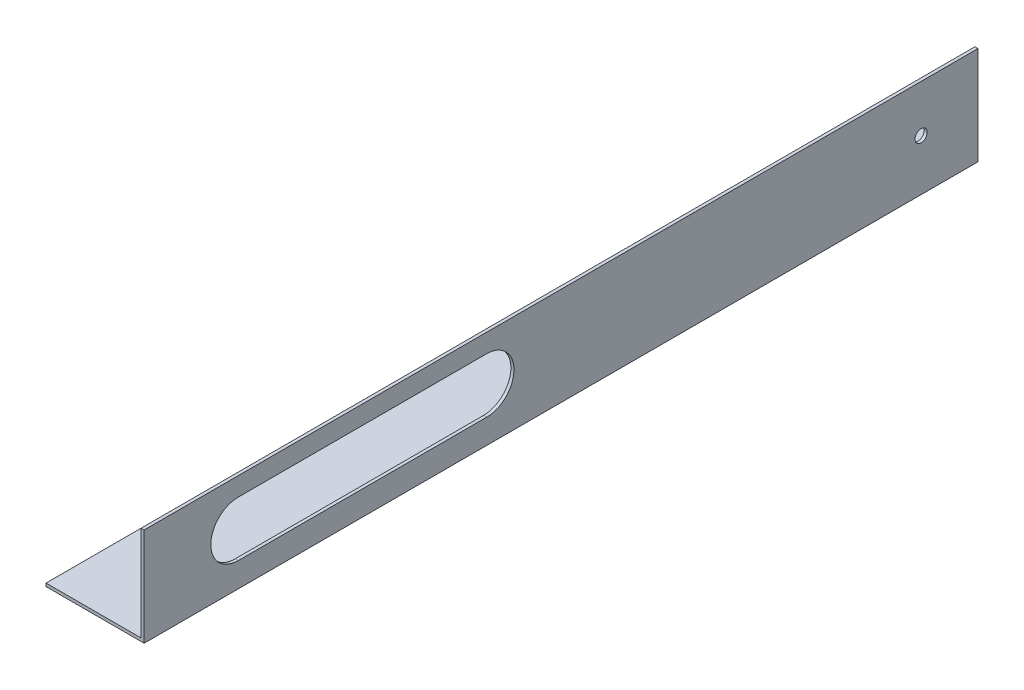
ISO-10303-21;
HEADER;
FILE_DESCRIPTION(('STEP AP214'),'2;1');
FILE_NAME('part.step','',(''),(''),'','','');
FILE_SCHEMA(('AUTOMOTIVE_DESIGN { 1 0 10303 214 1 1 1 1 }'));
ENDSEC;
DATA;
#1=APPLICATION_CONTEXT('core data for automotive mechanical design processes');
#2=APPLICATION_PROTOCOL_DEFINITION('international standard','automotive_design',2000,#1);
#3=PRODUCT_CONTEXT('',#1,'mechanical');
#4=PRODUCT('Part','Part','',(#3));
#5=PRODUCT_RELATED_PRODUCT_CATEGORY('part','',(#4));
#6=PRODUCT_DEFINITION_FORMATION('','',#4);
#7=PRODUCT_DEFINITION_CONTEXT('part definition',#1,'design');
#8=PRODUCT_DEFINITION('design','',#6,#7);
#9=PRODUCT_DEFINITION_SHAPE('','',#8);
#10=(LENGTH_UNIT() NAMED_UNIT(*) SI_UNIT(.MILLI.,.METRE.));
#11=(NAMED_UNIT(*) PLANE_ANGLE_UNIT() SI_UNIT($,.RADIAN.));
#12=(NAMED_UNIT(*) SI_UNIT($,.STERADIAN.) SOLID_ANGLE_UNIT());
#13=UNCERTAINTY_MEASURE_WITH_UNIT(LENGTH_MEASURE(1.E-05),#10,'distance_accuracy_value','');
#14=(GEOMETRIC_REPRESENTATION_CONTEXT(3) GLOBAL_UNCERTAINTY_ASSIGNED_CONTEXT((#13)) GLOBAL_UNIT_ASSIGNED_CONTEXT((#10,
#11,#12)) REPRESENTATION_CONTEXT('',''));
#15=CARTESIAN_POINT('',(0.,0.,0.));
#16=DIRECTION('',(0.,0.,1.));
#17=DIRECTION('',(1.,0.,0.));
#18=AXIS2_PLACEMENT_3D('',#15,#16,#17);
#19=CARTESIAN_POINT('',(50.8,0.,431.8));
#20=DIRECTION('',(0.,1.,0.));
#21=DIRECTION('',(-1.,0.,0.));
#22=AXIS2_PLACEMENT_3D('',#19,#20,#21);
#23=PLANE('',#22);
#24=DIRECTION('',(1.,0.,0.));
#25=VECTOR('',#24,1.);
#26=CARTESIAN_POINT('',(50.8,0.,0.));
#27=LINE('',#26,#25);
#28=CARTESIAN_POINT('',(0.,0.,0.));
#29=VERTEX_POINT('',#28);
#30=CARTESIAN_POINT('',(50.8,0.,0.));
#31=VERTEX_POINT('',#30);
#32=EDGE_CURVE('E155',#29,#31,#27,.T.);
#33=ORIENTED_EDGE('',*,*,#32,.T.);
#34=DIRECTION('',(0.,0.,-1.));
#35=VECTOR('',#34,1.);
#36=CARTESIAN_POINT('',(50.8,0.,431.8));
#37=LINE('',#36,#35);
#38=CARTESIAN_POINT('',(50.8,0.,431.8));
#39=VERTEX_POINT('',#38);
#40=EDGE_CURVE('E181',#39,#31,#37,.T.);
#41=ORIENTED_EDGE('',*,*,#40,.F.);
#42=DIRECTION('',(1.,0.,0.));
#43=VECTOR('',#42,1.);
#44=CARTESIAN_POINT('',(50.8,0.,431.8));
#45=LINE('',#44,#43);
#46=CARTESIAN_POINT('',(0.,0.,431.8));
#47=VERTEX_POINT('',#46);
#48=EDGE_CURVE('E140',#47,#39,#45,.T.);
#49=ORIENTED_EDGE('',*,*,#48,.F.);
#50=DIRECTION('',(0.,0.,-1.));
#51=VECTOR('',#50,1.);
#52=CARTESIAN_POINT('',(0.,0.,431.8));
#53=LINE('',#52,#51);
#54=EDGE_CURVE('E154',#47,#29,#53,.T.);
#55=ORIENTED_EDGE('',*,*,#54,.T.);
#56=EDGE_LOOP('',(#33,#41,#49,#55));
#57=FACE_BOUND('',#56,.T.);
#58=ADVANCED_FACE('F32',(#57),#23,.F.);
#59=CARTESIAN_POINT('',(50.8,50.8,431.8));
#60=DIRECTION('',(-1.,0.,0.));
#61=DIRECTION('',(0.,0.,1.));
#62=AXIS2_PLACEMENT_3D('',#59,#60,#61);
#63=PLANE('',#62);
#64=DIRECTION('',(0.,0.,1.));
#65=VECTOR('',#64,1.);
#66=CARTESIAN_POINT('',(50.8,41.148,254.508));
#67=LINE('',#66,#65);
#68=CARTESIAN_POINT('',(50.8,41.148,254.508));
#69=VERTEX_POINT('',#68);
#70=CARTESIAN_POINT('',(50.8,41.148,383.032));
#71=VERTEX_POINT('',#70);
#72=EDGE_CURVE('E120',#69,#71,#67,.T.);
#73=ORIENTED_EDGE('',*,*,#72,.F.);
#74=CARTESIAN_POINT('',(50.8,26.924,254.508));
#75=DIRECTION('',(1.,0.,0.));
#76=DIRECTION('',(0.,0.,-1.));
#77=AXIS2_PLACEMENT_3D('',#74,#75,#76);
#78=CIRCLE('',#77,14.224);
#79=CARTESIAN_POINT('',(50.8,12.7,254.508));
#80=VERTEX_POINT('',#79);
#81=EDGE_CURVE('E46',#80,#69,#78,.T.);
#82=ORIENTED_EDGE('',*,*,#81,.F.);
#83=DIRECTION('',(0.,0.,-1.));
#84=VECTOR('',#83,1.);
#85=CARTESIAN_POINT('',(50.8,12.7,254.508));
#86=LINE('',#85,#84);
#87=CARTESIAN_POINT('',(50.8,12.7,383.032));
#88=VERTEX_POINT('',#87);
#89=EDGE_CURVE('E127',#88,#80,#86,.T.);
#90=ORIENTED_EDGE('',*,*,#89,.F.);
#91=CARTESIAN_POINT('',(50.8,26.924,383.032));
#92=DIRECTION('',(1.,0.,0.));
#93=DIRECTION('',(0.,0.,-1.));
#94=AXIS2_PLACEMENT_3D('',#91,#92,#93);
#95=CIRCLE('',#94,14.224);
#96=EDGE_CURVE('E111',#71,#88,#95,.T.);
#97=ORIENTED_EDGE('',*,*,#96,.F.);
#98=EDGE_LOOP('',(#73,#82,#90,#97));
#99=FACE_BOUND('',#98,.T.);
#100=CARTESIAN_POINT('',(50.8,26.416,29.464));
#101=DIRECTION('',(1.,0.,0.));
#102=DIRECTION('',(0.,0.,-1.));
#103=AXIS2_PLACEMENT_3D('',#100,#101,#102);
#104=CIRCLE('',#103,3.175);
#105=CARTESIAN_POINT('',(50.8,26.416,26.289));
#106=VERTEX_POINT('',#105);
#107=EDGE_CURVE('E137',#106,#106,#104,.T.);
#108=ORIENTED_EDGE('',*,*,#107,.F.);
#109=EDGE_LOOP('',(#108));
#110=FACE_BOUND('',#109,.T.);
#111=DIRECTION('',(0.,1.,0.));
#112=VECTOR('',#111,1.);
#113=CARTESIAN_POINT('',(50.8,50.8,0.));
#114=LINE('',#113,#112);
#115=CARTESIAN_POINT('',(50.8,50.8,0.));
#116=VERTEX_POINT('',#115);
#117=EDGE_CURVE('E158',#31,#116,#114,.T.);
#118=ORIENTED_EDGE('',*,*,#117,.T.);
#119=DIRECTION('',(0.,0.,-1.));
#120=VECTOR('',#119,1.);
#121=CARTESIAN_POINT('',(50.8,50.8,431.8));
#122=LINE('',#121,#120);
#123=CARTESIAN_POINT('',(50.8,50.8,431.8));
#124=VERTEX_POINT('',#123);
#125=EDGE_CURVE('E178',#124,#116,#122,.T.);
#126=ORIENTED_EDGE('',*,*,#125,.F.);
#127=DIRECTION('',(0.,1.,0.));
#128=VECTOR('',#127,1.);
#129=CARTESIAN_POINT('',(50.8,50.8,431.8));
#130=LINE('',#129,#128);
#131=EDGE_CURVE('E143',#39,#124,#130,.T.);
#132=ORIENTED_EDGE('',*,*,#131,.F.);
#133=ORIENTED_EDGE('',*,*,#40,.T.);
#134=EDGE_LOOP('',(#118,#126,#132,#133));
#135=FACE_BOUND('',#134,.T.);
#136=ADVANCED_FACE('F124',(#99,#110,#135),#63,.F.);
#137=CARTESIAN_POINT('',(49.2125,50.8,431.8));
#138=DIRECTION('',(0.,-1.,0.));
#139=DIRECTION('',(0.,0.,-1.));
#140=AXIS2_PLACEMENT_3D('',#137,#138,#139);
#141=PLANE('',#140);
#142=DIRECTION('',(-1.,0.,0.));
#143=VECTOR('',#142,1.);
#144=CARTESIAN_POINT('',(49.2125,50.8,0.));
#145=LINE('',#144,#143);
#146=CARTESIAN_POINT('',(49.2125,50.8,0.));
#147=VERTEX_POINT('',#146);
#148=EDGE_CURVE('E160',#116,#147,#145,.T.);
#149=ORIENTED_EDGE('',*,*,#148,.T.);
#150=DIRECTION('',(0.,0.,-1.));
#151=VECTOR('',#150,1.);
#152=CARTESIAN_POINT('',(49.2125,50.8,431.8));
#153=LINE('',#152,#151);
#154=CARTESIAN_POINT('',(49.2125,50.8,431.8));
#155=VERTEX_POINT('',#154);
#156=EDGE_CURVE('E175',#155,#147,#153,.T.);
#157=ORIENTED_EDGE('',*,*,#156,.F.);
#158=DIRECTION('',(-1.,0.,0.));
#159=VECTOR('',#158,1.);
#160=CARTESIAN_POINT('',(49.2125,50.8,431.8));
#161=LINE('',#160,#159);
#162=EDGE_CURVE('E146',#124,#155,#161,.T.);
#163=ORIENTED_EDGE('',*,*,#162,.F.);
#164=ORIENTED_EDGE('',*,*,#125,.T.);
#165=EDGE_LOOP('',(#149,#157,#163,#164));
#166=FACE_BOUND('',#165,.T.);
#167=ADVANCED_FACE('F213',(#166),#141,.F.);
#168=CARTESIAN_POINT('',(49.2125,1.58749999999999,431.8));
#169=DIRECTION('',(1.,0.,0.));
#170=DIRECTION('',(0.,0.,-1.));
#171=AXIS2_PLACEMENT_3D('',#168,#169,#170);
#172=PLANE('',#171);
#173=DIRECTION('',(0.,0.,-1.));
#174=VECTOR('',#173,1.);
#175=CARTESIAN_POINT('',(49.2125,12.7,431.8));
#176=LINE('',#175,#174);
#177=CARTESIAN_POINT('',(49.2125,12.7,383.032));
#178=VERTEX_POINT('',#177);
#179=CARTESIAN_POINT('',(49.2125,12.7,254.508));
#180=VERTEX_POINT('',#179);
#181=EDGE_CURVE('E39',#178,#180,#176,.T.);
#182=ORIENTED_EDGE('',*,*,#181,.T.);
#183=CARTESIAN_POINT('',(49.2125,26.924,254.508));
#184=DIRECTION('',(1.,0.,0.));
#185=DIRECTION('',(0.,0.,-1.));
#186=AXIS2_PLACEMENT_3D('',#183,#184,#185);
#187=CIRCLE('',#186,14.224);
#188=CARTESIAN_POINT('',(49.2125,41.148,254.508));
#189=VERTEX_POINT('',#188);
#190=EDGE_CURVE('E11',#180,#189,#187,.T.);
#191=ORIENTED_EDGE('',*,*,#190,.T.);
#192=DIRECTION('',(0.,0.,1.));
#193=VECTOR('',#192,1.);
#194=CARTESIAN_POINT('',(49.2125,41.148,431.8));
#195=LINE('',#194,#193);
#196=CARTESIAN_POINT('',(49.2125,41.148,383.032));
#197=VERTEX_POINT('',#196);
#198=EDGE_CURVE('E184',#189,#197,#195,.T.);
#199=ORIENTED_EDGE('',*,*,#198,.T.);
#200=CARTESIAN_POINT('',(49.2125,26.924,383.032));
#201=DIRECTION('',(1.,0.,0.));
#202=DIRECTION('',(0.,0.,-1.));
#203=AXIS2_PLACEMENT_3D('',#200,#201,#202);
#204=CIRCLE('',#203,14.224);
#205=EDGE_CURVE('E114',#197,#178,#204,.T.);
#206=ORIENTED_EDGE('',*,*,#205,.T.);
#207=EDGE_LOOP('',(#182,#191,#199,#206));
#208=FACE_BOUND('',#207,.T.);
#209=CARTESIAN_POINT('',(49.2125,26.416,29.464));
#210=DIRECTION('',(1.,0.,0.));
#211=DIRECTION('',(0.,0.,-1.));
#212=AXIS2_PLACEMENT_3D('',#209,#210,#211);
#213=CIRCLE('',#212,3.175);
#214=CARTESIAN_POINT('',(49.2125,26.416,26.289));
#215=VERTEX_POINT('',#214);
#216=EDGE_CURVE('E134',#215,#215,#213,.T.);
#217=ORIENTED_EDGE('',*,*,#216,.T.);
#218=EDGE_LOOP('',(#217));
#219=FACE_BOUND('',#218,.T.);
#220=DIRECTION('',(0.,-1.,0.));
#221=VECTOR('',#220,1.);
#222=CARTESIAN_POINT('',(49.2125,1.58749999999999,0.));
#223=LINE('',#222,#221);
#224=CARTESIAN_POINT('',(49.2125,1.58749999999999,0.));
#225=VERTEX_POINT('',#224);
#226=EDGE_CURVE('E162',#147,#225,#223,.T.);
#227=ORIENTED_EDGE('',*,*,#226,.T.);
#228=DIRECTION('',(0.,0.,-1.));
#229=VECTOR('',#228,1.);
#230=CARTESIAN_POINT('',(49.2125,1.58749999999999,431.8));
#231=LINE('',#230,#229);
#232=CARTESIAN_POINT('',(49.2125,1.58749999999999,431.8));
#233=VERTEX_POINT('',#232);
#234=EDGE_CURVE('E172',#233,#225,#231,.T.);
#235=ORIENTED_EDGE('',*,*,#234,.F.);
#236=DIRECTION('',(0.,-1.,0.));
#237=VECTOR('',#236,1.);
#238=CARTESIAN_POINT('',(49.2125,1.58749999999999,431.8));
#239=LINE('',#238,#237);
#240=EDGE_CURVE('E148',#155,#233,#239,.T.);
#241=ORIENTED_EDGE('',*,*,#240,.F.);
#242=ORIENTED_EDGE('',*,*,#156,.T.);
#243=EDGE_LOOP('',(#227,#235,#241,#242));
#244=FACE_BOUND('',#243,.T.);
#245=ADVANCED_FACE('F190',(#208,#219,#244),#172,.F.);
#246=CARTESIAN_POINT('',(0.,1.58749999999999,431.8));
#247=DIRECTION('',(0.,-1.,0.));
#248=DIRECTION('',(0.,0.,-1.));
#249=AXIS2_PLACEMENT_3D('',#246,#247,#248);
#250=PLANE('',#249);
#251=DIRECTION('',(-1.,0.,0.));
#252=VECTOR('',#251,1.);
#253=CARTESIAN_POINT('',(0.,1.58749999999999,0.));
#254=LINE('',#253,#252);
#255=CARTESIAN_POINT('',(0.,1.58749999999999,0.));
#256=VERTEX_POINT('',#255);
#257=EDGE_CURVE('E164',#225,#256,#254,.T.);
#258=ORIENTED_EDGE('',*,*,#257,.T.);
#259=DIRECTION('',(0.,0.,-1.));
#260=VECTOR('',#259,1.);
#261=CARTESIAN_POINT('',(0.,1.58749999999999,431.8));
#262=LINE('',#261,#260);
#263=CARTESIAN_POINT('',(0.,1.58749999999999,431.8));
#264=VERTEX_POINT('',#263);
#265=EDGE_CURVE('E169',#264,#256,#262,.T.);
#266=ORIENTED_EDGE('',*,*,#265,.F.);
#267=DIRECTION('',(-1.,0.,0.));
#268=VECTOR('',#267,1.);
#269=CARTESIAN_POINT('',(0.,1.58749999999999,431.8));
#270=LINE('',#269,#268);
#271=EDGE_CURVE('E150',#233,#264,#270,.T.);
#272=ORIENTED_EDGE('',*,*,#271,.F.);
#273=ORIENTED_EDGE('',*,*,#234,.T.);
#274=EDGE_LOOP('',(#258,#266,#272,#273));
#275=FACE_BOUND('',#274,.T.);
#276=ADVANCED_FACE('F234',(#275),#250,.F.);
#277=CARTESIAN_POINT('',(0.,0.,431.8));
#278=DIRECTION('',(1.,0.,0.));
#279=DIRECTION('',(0.,0.,-1.));
#280=AXIS2_PLACEMENT_3D('',#277,#278,#279);
#281=PLANE('',#280);
#282=DIRECTION('',(0.,-1.,0.));
#283=VECTOR('',#282,1.);
#284=CARTESIAN_POINT('',(0.,0.,0.));
#285=LINE('',#284,#283);
#286=EDGE_CURVE('E144',#256,#29,#285,.T.);
#287=ORIENTED_EDGE('',*,*,#286,.T.);
#288=ORIENTED_EDGE('',*,*,#54,.F.);
#289=DIRECTION('',(0.,-1.,0.));
#290=VECTOR('',#289,1.);
#291=CARTESIAN_POINT('',(0.,0.,431.8));
#292=LINE('',#291,#290);
#293=EDGE_CURVE('E152',#264,#47,#292,.T.);
#294=ORIENTED_EDGE('',*,*,#293,.F.);
#295=ORIENTED_EDGE('',*,*,#265,.T.);
#296=EDGE_LOOP('',(#287,#288,#294,#295));
#297=FACE_BOUND('',#296,.T.);
#298=ADVANCED_FACE('F232',(#297),#281,.F.);
#299=CARTESIAN_POINT('',(0.,0.,431.8));
#300=DIRECTION('',(0.,0.,-1.));
#301=DIRECTION('',(-1.,0.,0.));
#302=AXIS2_PLACEMENT_3D('',#299,#300,#301);
#303=PLANE('',#302);
#304=ORIENTED_EDGE('',*,*,#48,.T.);
#305=ORIENTED_EDGE('',*,*,#131,.T.);
#306=ORIENTED_EDGE('',*,*,#162,.T.);
#307=ORIENTED_EDGE('',*,*,#240,.T.);
#308=ORIENTED_EDGE('',*,*,#271,.T.);
#309=ORIENTED_EDGE('',*,*,#293,.T.);
#310=EDGE_LOOP('',(#304,#305,#306,#307,#308,#309));
#311=FACE_BOUND('',#310,.T.);
#312=ADVANCED_FACE('F227',(#311),#303,.F.);
#313=CARTESIAN_POINT('',(0.,0.,0.));
#314=DIRECTION('',(0.,0.,-1.));
#315=DIRECTION('',(-1.,0.,0.));
#316=AXIS2_PLACEMENT_3D('',#313,#314,#315);
#317=PLANE('',#316);
#318=ORIENTED_EDGE('',*,*,#32,.F.);
#319=ORIENTED_EDGE('',*,*,#286,.F.);
#320=ORIENTED_EDGE('',*,*,#257,.F.);
#321=ORIENTED_EDGE('',*,*,#226,.F.);
#322=ORIENTED_EDGE('',*,*,#148,.F.);
#323=ORIENTED_EDGE('',*,*,#117,.F.);
#324=EDGE_LOOP('',(#318,#319,#320,#321,#322,#323));
#325=FACE_BOUND('',#324,.T.);
#326=ADVANCED_FACE('F204',(#325),#317,.T.);
#327=CARTESIAN_POINT('',(48.26,26.416,29.464));
#328=DIRECTION('',(1.,0.,0.));
#329=DIRECTION('',(0.,0.,-1.));
#330=AXIS2_PLACEMENT_3D('',#327,#328,#329);
#331=CYLINDRICAL_SURFACE('',#330,3.175);
#332=ORIENTED_EDGE('',*,*,#107,.T.);
#333=EDGE_LOOP('',(#332));
#334=FACE_BOUND('',#333,.T.);
#335=ORIENTED_EDGE('',*,*,#216,.F.);
#336=EDGE_LOOP('',(#335));
#337=FACE_BOUND('',#336,.T.);
#338=ADVANCED_FACE('F197',(#334,#337),#331,.F.);
#339=CARTESIAN_POINT('',(48.26,26.924,254.508));
#340=DIRECTION('',(1.,0.,0.));
#341=DIRECTION('',(0.,0.,-1.));
#342=AXIS2_PLACEMENT_3D('',#339,#340,#341);
#343=CYLINDRICAL_SURFACE('',#342,14.224);
#344=DIRECTION('',(1.,0.,0.));
#345=VECTOR('',#344,1.);
#346=CARTESIAN_POINT('',(48.26,12.7,254.508));
#347=LINE('',#346,#345);
#348=EDGE_CURVE('E132',#180,#80,#347,.T.);
#349=ORIENTED_EDGE('',*,*,#348,.T.);
#350=ORIENTED_EDGE('',*,*,#81,.T.);
#351=DIRECTION('',(1.,0.,0.));
#352=VECTOR('',#351,1.);
#353=CARTESIAN_POINT('',(48.26,41.148,254.508));
#354=LINE('',#353,#352);
#355=EDGE_CURVE('E117',#189,#69,#354,.T.);
#356=ORIENTED_EDGE('',*,*,#355,.F.);
#357=ORIENTED_EDGE('',*,*,#190,.F.);
#358=EDGE_LOOP('',(#349,#350,#356,#357));
#359=FACE_BOUND('',#358,.T.);
#360=ADVANCED_FACE('F195',(#359),#343,.F.);
#361=CARTESIAN_POINT('',(48.26,12.7,254.508));
#362=DIRECTION('',(0.,-1.,0.));
#363=DIRECTION('',(0.,0.,-1.));
#364=AXIS2_PLACEMENT_3D('',#361,#362,#363);
#365=PLANE('',#364);
#366=DIRECTION('',(1.,0.,0.));
#367=VECTOR('',#366,1.);
#368=CARTESIAN_POINT('',(48.26,12.7,383.032));
#369=LINE('',#368,#367);
#370=EDGE_CURVE('E116',#178,#88,#369,.T.);
#371=ORIENTED_EDGE('',*,*,#370,.T.);
#372=ORIENTED_EDGE('',*,*,#89,.T.);
#373=ORIENTED_EDGE('',*,*,#348,.F.);
#374=ORIENTED_EDGE('',*,*,#181,.F.);
#375=EDGE_LOOP('',(#371,#372,#373,#374));
#376=FACE_BOUND('',#375,.T.);
#377=ADVANCED_FACE('F194',(#376),#365,.F.);
#378=CARTESIAN_POINT('',(48.26,26.924,383.032));
#379=DIRECTION('',(1.,0.,0.));
#380=DIRECTION('',(0.,0.,-1.));
#381=AXIS2_PLACEMENT_3D('',#378,#379,#380);
#382=CYLINDRICAL_SURFACE('',#381,14.224);
#383=DIRECTION('',(1.,0.,0.));
#384=VECTOR('',#383,1.);
#385=CARTESIAN_POINT('',(48.26,41.148,383.032));
#386=LINE('',#385,#384);
#387=EDGE_CURVE('E54',#197,#71,#386,.T.);
#388=ORIENTED_EDGE('',*,*,#387,.T.);
#389=ORIENTED_EDGE('',*,*,#96,.T.);
#390=ORIENTED_EDGE('',*,*,#370,.F.);
#391=ORIENTED_EDGE('',*,*,#205,.F.);
#392=EDGE_LOOP('',(#388,#389,#390,#391));
#393=FACE_BOUND('',#392,.T.);
#394=ADVANCED_FACE('F108',(#393),#382,.F.);
#395=CARTESIAN_POINT('',(48.26,41.148,254.508));
#396=DIRECTION('',(0.,1.,0.));
#397=DIRECTION('',(0.,0.,1.));
#398=AXIS2_PLACEMENT_3D('',#395,#396,#397);
#399=PLANE('',#398);
#400=ORIENTED_EDGE('',*,*,#355,.T.);
#401=ORIENTED_EDGE('',*,*,#72,.T.);
#402=ORIENTED_EDGE('',*,*,#387,.F.);
#403=ORIENTED_EDGE('',*,*,#198,.F.);
#404=EDGE_LOOP('',(#400,#401,#402,#403));
#405=FACE_BOUND('',#404,.T.);
#406=ADVANCED_FACE('F121',(#405),#399,.F.);
#407=CLOSED_SHELL('',(#58,#136,#167,#245,#276,#298,#312,#326,#338,#360,#377,#394,#406));
#408=MANIFOLD_SOLID_BREP('B2',#407);
#409=ADVANCED_BREP_SHAPE_REPRESENTATION('',(#18,#408),#14);
#410=SHAPE_DEFINITION_REPRESENTATION(#9,#409);
ENDSEC;
END-ISO-10303-21;
